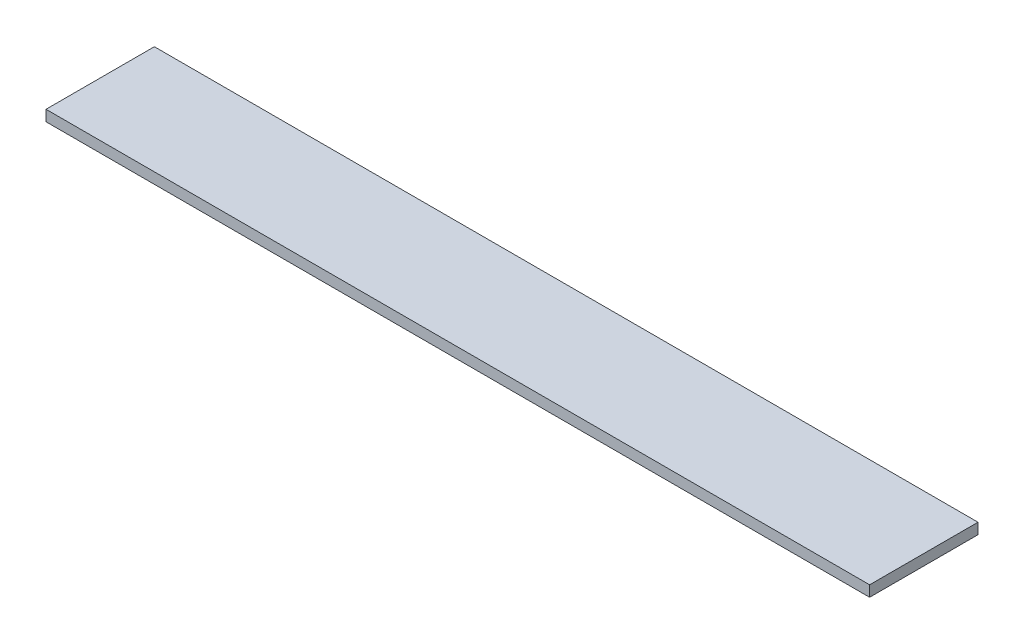
ISO-10303-21;
HEADER;
FILE_DESCRIPTION(('STEP AP214'),'2;1');
FILE_NAME('part.step','',(''),(''),'','','');
FILE_SCHEMA(('AUTOMOTIVE_DESIGN { 1 0 10303 214 1 1 1 1 }'));
ENDSEC;
DATA;
#1=APPLICATION_CONTEXT('core data for automotive mechanical design processes');
#2=APPLICATION_PROTOCOL_DEFINITION('international standard','automotive_design',2000,#1);
#3=PRODUCT_CONTEXT('',#1,'mechanical');
#4=PRODUCT('Part','Part','',(#3));
#5=PRODUCT_RELATED_PRODUCT_CATEGORY('part','',(#4));
#6=PRODUCT_DEFINITION_FORMATION('','',#4);
#7=PRODUCT_DEFINITION_CONTEXT('part definition',#1,'design');
#8=PRODUCT_DEFINITION('design','',#6,#7);
#9=PRODUCT_DEFINITION_SHAPE('','',#8);
#10=(LENGTH_UNIT() NAMED_UNIT(*) SI_UNIT(.MILLI.,.METRE.));
#11=(NAMED_UNIT(*) PLANE_ANGLE_UNIT() SI_UNIT($,.RADIAN.));
#12=(NAMED_UNIT(*) SI_UNIT($,.STERADIAN.) SOLID_ANGLE_UNIT());
#13=UNCERTAINTY_MEASURE_WITH_UNIT(LENGTH_MEASURE(1.E-05),#10,'distance_accuracy_value','');
#14=(GEOMETRIC_REPRESENTATION_CONTEXT(3) GLOBAL_UNCERTAINTY_ASSIGNED_CONTEXT((#13)) GLOBAL_UNIT_ASSIGNED_CONTEXT((#10,
#11,#12)) REPRESENTATION_CONTEXT('',''));
#15=CARTESIAN_POINT('',(0.,0.,0.));
#16=DIRECTION('',(0.,0.,1.));
#17=DIRECTION('',(1.,0.,0.));
#18=AXIS2_PLACEMENT_3D('',#15,#16,#17);
#19=CARTESIAN_POINT('',(-380.,10.,-50.));
#20=DIRECTION('',(1.,0.,0.));
#21=DIRECTION('',(0.,0.,-1.));
#22=AXIS2_PLACEMENT_3D('',#19,#20,#21);
#23=PLANE('',#22);
#24=DIRECTION('',(0.,0.,1.));
#25=VECTOR('',#24,1.);
#26=CARTESIAN_POINT('',(-380.,0.,-50.));
#27=LINE('',#26,#25);
#28=CARTESIAN_POINT('',(-380.,0.,-50.));
#29=VERTEX_POINT('',#28);
#30=CARTESIAN_POINT('',(-380.,0.,50.));
#31=VERTEX_POINT('',#30);
#32=EDGE_CURVE('E98',#29,#31,#27,.T.);
#33=ORIENTED_EDGE('',*,*,#32,.T.);
#34=DIRECTION('',(0.,-1.,0.));
#35=VECTOR('',#34,1.);
#36=CARTESIAN_POINT('',(-380.,10.,50.));
#37=LINE('',#36,#35);
#38=CARTESIAN_POINT('',(-380.,10.,50.));
#39=VERTEX_POINT('',#38);
#40=EDGE_CURVE('E11',#39,#31,#37,.T.);
#41=ORIENTED_EDGE('',*,*,#40,.F.);
#42=DIRECTION('',(0.,0.,1.));
#43=VECTOR('',#42,1.);
#44=CARTESIAN_POINT('',(-380.,10.,-50.));
#45=LINE('',#44,#43);
#46=CARTESIAN_POINT('',(-380.,10.,-50.));
#47=VERTEX_POINT('',#46);
#48=EDGE_CURVE('E86',#47,#39,#45,.T.);
#49=ORIENTED_EDGE('',*,*,#48,.F.);
#50=DIRECTION('',(0.,-1.,0.));
#51=VECTOR('',#50,1.);
#52=CARTESIAN_POINT('',(-380.,10.,-50.));
#53=LINE('',#52,#51);
#54=EDGE_CURVE('E94',#47,#29,#53,.T.);
#55=ORIENTED_EDGE('',*,*,#54,.T.);
#56=EDGE_LOOP('',(#33,#41,#49,#55));
#57=FACE_BOUND('',#56,.T.);
#58=ADVANCED_FACE('F35',(#57),#23,.F.);
#59=CARTESIAN_POINT('',(-380.,10.,50.));
#60=DIRECTION('',(0.,0.,-1.));
#61=DIRECTION('',(-1.,0.,0.));
#62=AXIS2_PLACEMENT_3D('',#59,#60,#61);
#63=PLANE('',#62);
#64=DIRECTION('',(1.,0.,0.));
#65=VECTOR('',#64,1.);
#66=CARTESIAN_POINT('',(-380.,0.,50.));
#67=LINE('',#66,#65);
#68=CARTESIAN_POINT('',(380.,0.,50.));
#69=VERTEX_POINT('',#68);
#70=EDGE_CURVE('E90',#31,#69,#67,.T.);
#71=ORIENTED_EDGE('',*,*,#70,.T.);
#72=DIRECTION('',(0.,-1.,0.));
#73=VECTOR('',#72,1.);
#74=CARTESIAN_POINT('',(380.,10.,50.));
#75=LINE('',#74,#73);
#76=CARTESIAN_POINT('',(380.,10.,50.));
#77=VERTEX_POINT('',#76);
#78=EDGE_CURVE('E43',#77,#69,#75,.T.);
#79=ORIENTED_EDGE('',*,*,#78,.F.);
#80=DIRECTION('',(1.,0.,0.));
#81=VECTOR('',#80,1.);
#82=CARTESIAN_POINT('',(-380.,10.,50.));
#83=LINE('',#82,#81);
#84=EDGE_CURVE('E81',#39,#77,#83,.T.);
#85=ORIENTED_EDGE('',*,*,#84,.F.);
#86=ORIENTED_EDGE('',*,*,#40,.T.);
#87=EDGE_LOOP('',(#71,#79,#85,#86));
#88=FACE_BOUND('',#87,.T.);
#89=ADVANCED_FACE('F89',(#88),#63,.F.);
#90=CARTESIAN_POINT('',(380.,10.,-50.));
#91=DIRECTION('',(-1.,0.,0.));
#92=DIRECTION('',(0.,0.,1.));
#93=AXIS2_PLACEMENT_3D('',#90,#91,#92);
#94=PLANE('',#93);
#95=DIRECTION('',(0.,0.,-1.));
#96=VECTOR('',#95,1.);
#97=CARTESIAN_POINT('',(380.,0.,-50.));
#98=LINE('',#97,#96);
#99=CARTESIAN_POINT('',(380.,0.,-50.));
#100=VERTEX_POINT('',#99);
#101=EDGE_CURVE('E68',#69,#100,#98,.T.);
#102=ORIENTED_EDGE('',*,*,#101,.T.);
#103=DIRECTION('',(0.,-1.,0.));
#104=VECTOR('',#103,1.);
#105=CARTESIAN_POINT('',(380.,10.,-50.));
#106=LINE('',#105,#104);
#107=CARTESIAN_POINT('',(380.,10.,-50.));
#108=VERTEX_POINT('',#107);
#109=EDGE_CURVE('E91',#108,#100,#106,.T.);
#110=ORIENTED_EDGE('',*,*,#109,.F.);
#111=DIRECTION('',(0.,0.,-1.));
#112=VECTOR('',#111,1.);
#113=CARTESIAN_POINT('',(380.,10.,-50.));
#114=LINE('',#113,#112);
#115=EDGE_CURVE('E84',#77,#108,#114,.T.);
#116=ORIENTED_EDGE('',*,*,#115,.F.);
#117=ORIENTED_EDGE('',*,*,#78,.T.);
#118=EDGE_LOOP('',(#102,#110,#116,#117));
#119=FACE_BOUND('',#118,.T.);
#120=ADVANCED_FACE('F92',(#119),#94,.F.);
#121=CARTESIAN_POINT('',(-380.,10.,-50.));
#122=DIRECTION('',(0.,0.,1.));
#123=DIRECTION('',(1.,0.,0.));
#124=AXIS2_PLACEMENT_3D('',#121,#122,#123);
#125=PLANE('',#124);
#126=DIRECTION('',(-1.,0.,0.));
#127=VECTOR('',#126,1.);
#128=CARTESIAN_POINT('',(-380.,0.,-50.));
#129=LINE('',#128,#127);
#130=EDGE_CURVE('E74',#100,#29,#129,.T.);
#131=ORIENTED_EDGE('',*,*,#130,.T.);
#132=ORIENTED_EDGE('',*,*,#54,.F.);
#133=DIRECTION('',(-1.,0.,0.));
#134=VECTOR('',#133,1.);
#135=CARTESIAN_POINT('',(-380.,10.,-50.));
#136=LINE('',#135,#134);
#137=EDGE_CURVE('E51',#108,#47,#136,.T.);
#138=ORIENTED_EDGE('',*,*,#137,.F.);
#139=ORIENTED_EDGE('',*,*,#109,.T.);
#140=EDGE_LOOP('',(#131,#132,#138,#139));
#141=FACE_BOUND('',#140,.T.);
#142=ADVANCED_FACE('F105',(#141),#125,.F.);
#143=CARTESIAN_POINT('',(0.,10.,0.));
#144=DIRECTION('',(0.,1.,0.));
#145=DIRECTION('',(0.,0.,1.));
#146=AXIS2_PLACEMENT_3D('',#143,#144,#145);
#147=PLANE('',#146);
#148=ORIENTED_EDGE('',*,*,#48,.T.);
#149=ORIENTED_EDGE('',*,*,#84,.T.);
#150=ORIENTED_EDGE('',*,*,#115,.T.);
#151=ORIENTED_EDGE('',*,*,#137,.T.);
#152=EDGE_LOOP('',(#148,#149,#150,#151));
#153=FACE_BOUND('',#152,.T.);
#154=ADVANCED_FACE('F82',(#153),#147,.T.);
#155=CARTESIAN_POINT('',(0.,0.,0.));
#156=DIRECTION('',(0.,1.,0.));
#157=DIRECTION('',(0.,0.,1.));
#158=AXIS2_PLACEMENT_3D('',#155,#156,#157);
#159=PLANE('',#158);
#160=ORIENTED_EDGE('',*,*,#32,.F.);
#161=ORIENTED_EDGE('',*,*,#130,.F.);
#162=ORIENTED_EDGE('',*,*,#101,.F.);
#163=ORIENTED_EDGE('',*,*,#70,.F.);
#164=EDGE_LOOP('',(#160,#161,#162,#163));
#165=FACE_BOUND('',#164,.T.);
#166=ADVANCED_FACE('F108',(#165),#159,.F.);
#167=CLOSED_SHELL('',(#58,#89,#120,#142,#154,#166));
#168=MANIFOLD_SOLID_BREP('B2',#167);
#169=ADVANCED_BREP_SHAPE_REPRESENTATION('',(#18,#168),#14);
#170=SHAPE_DEFINITION_REPRESENTATION(#9,#169);
ENDSEC;
END-ISO-10303-21;
